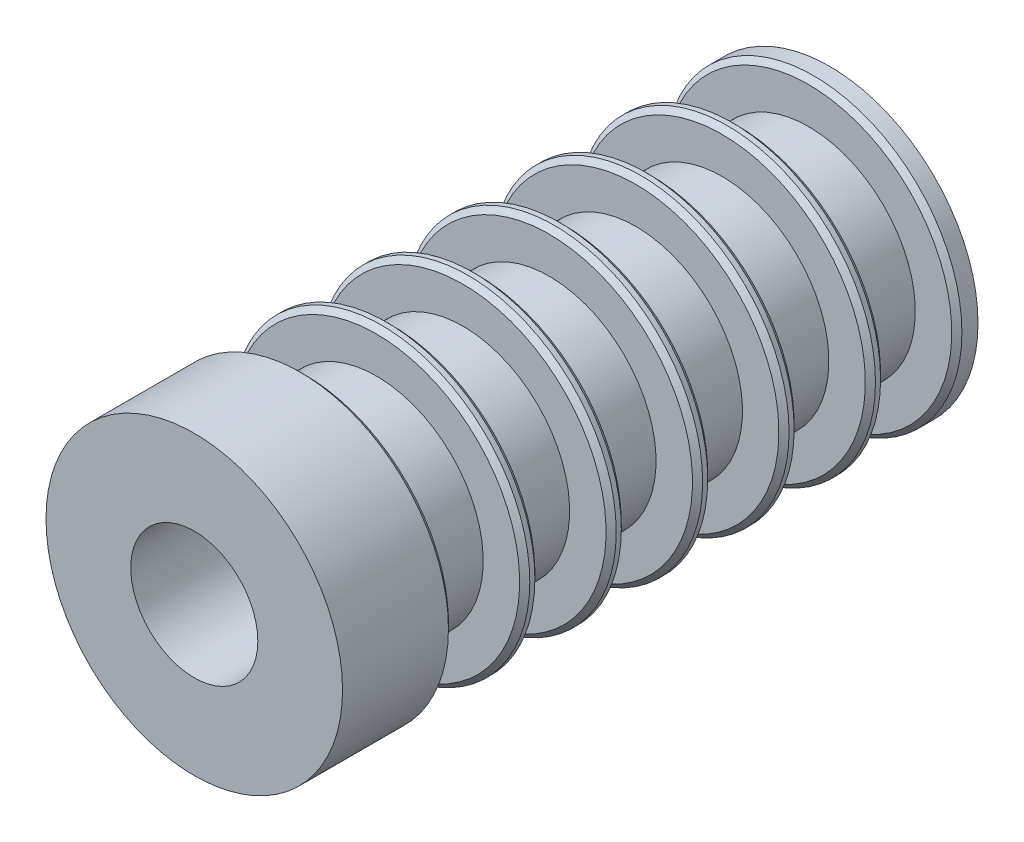
ISO-10303-21;
HEADER;
FILE_DESCRIPTION(('STEP AP214'),'2;1');
FILE_NAME('part.step','',(''),(''),'','','');
FILE_SCHEMA(('AUTOMOTIVE_DESIGN { 1 0 10303 214 1 1 1 1 }'));
ENDSEC;
DATA;
#1=APPLICATION_CONTEXT('core data for automotive mechanical design processes');
#2=APPLICATION_PROTOCOL_DEFINITION('international standard','automotive_design',2000,#1);
#3=PRODUCT_CONTEXT('',#1,'mechanical');
#4=PRODUCT('Part','Part','',(#3));
#5=PRODUCT_RELATED_PRODUCT_CATEGORY('part','',(#4));
#6=PRODUCT_DEFINITION_FORMATION('','',#4);
#7=PRODUCT_DEFINITION_CONTEXT('part definition',#1,'design');
#8=PRODUCT_DEFINITION('design','',#6,#7);
#9=PRODUCT_DEFINITION_SHAPE('','',#8);
#10=(LENGTH_UNIT() NAMED_UNIT(*) SI_UNIT(.MILLI.,.METRE.));
#11=(NAMED_UNIT(*) PLANE_ANGLE_UNIT() SI_UNIT($,.RADIAN.));
#12=(NAMED_UNIT(*) SI_UNIT($,.STERADIAN.) SOLID_ANGLE_UNIT());
#13=UNCERTAINTY_MEASURE_WITH_UNIT(LENGTH_MEASURE(1.E-05),#10,'distance_accuracy_value','');
#14=(GEOMETRIC_REPRESENTATION_CONTEXT(3) GLOBAL_UNCERTAINTY_ASSIGNED_CONTEXT((#13)) GLOBAL_UNIT_ASSIGNED_CONTEXT((#10,
#11,#12)) REPRESENTATION_CONTEXT('',''));
#15=CARTESIAN_POINT('',(0.,0.,0.));
#16=DIRECTION('',(0.,0.,1.));
#17=DIRECTION('',(1.,0.,0.));
#18=AXIS2_PLACEMENT_3D('',#15,#16,#17);
#19=CARTESIAN_POINT('',(0.,0.,25.4));
#20=DIRECTION('',(0.,0.,-1.));
#21=DIRECTION('',(-1.,0.,0.));
#22=AXIS2_PLACEMENT_3D('',#19,#20,#21);
#23=CYLINDRICAL_SURFACE('',#22,11.1125);
#24=CARTESIAN_POINT('',(0.,0.,14.2875));
#25=DIRECTION('',(0.,0.,-1.));
#26=DIRECTION('',(-1.,0.,0.));
#27=AXIS2_PLACEMENT_3D('',#24,#25,#26);
#28=CIRCLE('',#27,11.1125);
#29=CARTESIAN_POINT('',(-11.1125,0.,14.2875));
#30=VERTEX_POINT('',#29);
#31=EDGE_CURVE('E10',#30,#30,#28,.F.);
#32=ORIENTED_EDGE('',*,*,#31,.T.);
#33=EDGE_LOOP('',(#32));
#34=FACE_BOUND('',#33,.T.);
#35=CARTESIAN_POINT('',(0.,0.,22.225));
#36=DIRECTION('',(0.,0.,1.));
#37=DIRECTION('',(1.,0.,0.));
#38=AXIS2_PLACEMENT_3D('',#35,#36,#37);
#39=CIRCLE('',#38,11.1125);
#40=CARTESIAN_POINT('',(11.1125,0.,22.225));
#41=VERTEX_POINT('',#40);
#42=EDGE_CURVE('E116',#41,#41,#39,.T.);
#43=ORIENTED_EDGE('',*,*,#42,.F.);
#44=EDGE_LOOP('',(#43));
#45=FACE_BOUND('',#44,.T.);
#46=ADVANCED_FACE('F33',(#34,#45),#23,.T.);
#47=CARTESIAN_POINT('',(0.,0.,-17.7165));
#48=DIRECTION('',(0.,0.,-1.));
#49=DIRECTION('',(-1.,0.,0.));
#50=AXIS2_PLACEMENT_3D('',#47,#48,#49);
#51=CIRCLE('',#50,11.1125);
#52=CARTESIAN_POINT('',(-11.1125,0.,-17.7165));
#53=VERTEX_POINT('',#52);
#54=EDGE_CURVE('E98',#53,#53,#51,.T.);
#55=ORIENTED_EDGE('',*,*,#54,.T.);
#56=EDGE_LOOP('',(#55));
#57=FACE_BOUND('',#56,.T.);
#58=CARTESIAN_POINT('',(0.,0.,-18.0975));
#59=DIRECTION('',(0.,0.,-1.));
#60=DIRECTION('',(-1.,0.,0.));
#61=AXIS2_PLACEMENT_3D('',#58,#59,#60);
#62=CIRCLE('',#61,11.1125);
#63=CARTESIAN_POINT('',(-11.1125,0.,-18.0975));
#64=VERTEX_POINT('',#63);
#65=EDGE_CURVE('E101',#64,#64,#62,.F.);
#66=ORIENTED_EDGE('',*,*,#65,.T.);
#67=EDGE_LOOP('',(#66));
#68=FACE_BOUND('',#67,.T.);
#69=ADVANCED_FACE('F182',(#57,#68),#23,.T.);
#70=CARTESIAN_POINT('',(0.,0.,-24.1935));
#71=DIRECTION('',(0.,0.,-1.));
#72=DIRECTION('',(-1.,0.,0.));
#73=AXIS2_PLACEMENT_3D('',#70,#71,#72);
#74=CIRCLE('',#73,11.1125);
#75=CARTESIAN_POINT('',(-11.1125,0.,-24.1935));
#76=VERTEX_POINT('',#75);
#77=EDGE_CURVE('E110',#76,#76,#74,.T.);
#78=ORIENTED_EDGE('',*,*,#77,.T.);
#79=EDGE_LOOP('',(#78));
#80=FACE_BOUND('',#79,.T.);
#81=CARTESIAN_POINT('',(0.,0.,-25.4));
#82=DIRECTION('',(0.,0.,1.));
#83=DIRECTION('',(1.,0.,0.));
#84=AXIS2_PLACEMENT_3D('',#81,#82,#83);
#85=CIRCLE('',#84,11.1125);
#86=CARTESIAN_POINT('',(11.1125,0.,-25.4));
#87=VERTEX_POINT('',#86);
#88=EDGE_CURVE('E113',#87,#87,#85,.T.);
#89=ORIENTED_EDGE('',*,*,#88,.T.);
#90=EDGE_LOOP('',(#89));
#91=FACE_BOUND('',#90,.T.);
#92=ADVANCED_FACE('F188',(#80,#91),#23,.T.);
#93=CARTESIAN_POINT('',(0.,0.,-25.4));
#94=DIRECTION('',(0.,0.,1.));
#95=DIRECTION('',(1.,0.,0.));
#96=AXIS2_PLACEMENT_3D('',#93,#94,#95);
#97=PLANE('',#96);
#98=CARTESIAN_POINT('',(0.,0.,-25.4));
#99=DIRECTION('',(0.,0.,1.));
#100=DIRECTION('',(1.,0.,0.));
#101=AXIS2_PLACEMENT_3D('',#98,#99,#100);
#102=CIRCLE('',#101,4.7625);
#103=CARTESIAN_POINT('',(4.7625,0.,-25.4));
#104=VERTEX_POINT('',#103);
#105=EDGE_CURVE('E119',#104,#104,#102,.T.);
#106=ORIENTED_EDGE('',*,*,#105,.T.);
#107=EDGE_LOOP('',(#106));
#108=FACE_BOUND('',#107,.T.);
#109=ORIENTED_EDGE('',*,*,#88,.F.);
#110=EDGE_LOOP('',(#109));
#111=FACE_BOUND('',#110,.T.);
#112=ADVANCED_FACE('F283',(#108,#111),#97,.F.);
#113=CARTESIAN_POINT('',(0.,0.,22.225));
#114=DIRECTION('',(0.,0.,1.));
#115=DIRECTION('',(1.,0.,0.));
#116=AXIS2_PLACEMENT_3D('',#113,#114,#115);
#117=PLANE('',#116);
#118=CARTESIAN_POINT('',(0.,0.,22.225));
#119=DIRECTION('',(0.,0.,1.));
#120=DIRECTION('',(1.,0.,0.));
#121=AXIS2_PLACEMENT_3D('',#118,#119,#120);
#122=CIRCLE('',#121,4.7625);
#123=CARTESIAN_POINT('',(4.7625,0.,22.225));
#124=VERTEX_POINT('',#123);
#125=EDGE_CURVE('E120',#124,#124,#122,.T.);
#126=ORIENTED_EDGE('',*,*,#125,.F.);
#127=EDGE_LOOP('',(#126));
#128=FACE_BOUND('',#127,.T.);
#129=ORIENTED_EDGE('',*,*,#42,.T.);
#130=EDGE_LOOP('',(#129));
#131=FACE_BOUND('',#130,.T.);
#132=ADVANCED_FACE('F280',(#128,#131),#117,.T.);
#133=CARTESIAN_POINT('',(0.,0.,-25.4));
#134=DIRECTION('',(0.,0.,1.));
#135=DIRECTION('',(1.,0.,0.));
#136=AXIS2_PLACEMENT_3D('',#133,#134,#135);
#137=CYLINDRICAL_SURFACE('',#136,4.7625);
#138=ORIENTED_EDGE('',*,*,#105,.F.);
#139=EDGE_LOOP('',(#138));
#140=FACE_BOUND('',#139,.T.);
#141=ORIENTED_EDGE('',*,*,#125,.T.);
#142=EDGE_LOOP('',(#141));
#143=FACE_BOUND('',#142,.T.);
#144=ADVANCED_FACE('F273',(#140,#143),#137,.F.);
#145=CARTESIAN_POINT('',(0.,0.,-18.4785));
#146=DIRECTION('',(0.,0.,-1.));
#147=DIRECTION('',(-1.,0.,0.));
#148=AXIS2_PLACEMENT_3D('',#145,#146,#147);
#149=PLANE('',#148);
#150=CARTESIAN_POINT('',(0.,0.,-18.4785));
#151=DIRECTION('',(0.,0.,-1.));
#152=DIRECTION('',(-1.,0.,0.));
#153=AXIS2_PLACEMENT_3D('',#150,#151,#152);
#154=CIRCLE('',#153,10.7315);
#155=CARTESIAN_POINT('',(-10.7315,0.,-18.4785));
#156=VERTEX_POINT('',#155);
#157=EDGE_CURVE('E104',#156,#156,#154,.T.);
#158=ORIENTED_EDGE('',*,*,#157,.T.);
#159=EDGE_LOOP('',(#158));
#160=FACE_BOUND('',#159,.T.);
#161=CARTESIAN_POINT('',(0.,0.,-18.4785));
#162=DIRECTION('',(0.,0.,-1.));
#163=DIRECTION('',(-1.,0.,0.));
#164=AXIS2_PLACEMENT_3D('',#161,#162,#163);
#165=CIRCLE('',#164,8.001);
#166=CARTESIAN_POINT('',(-8.001,0.,-18.4785));
#167=VERTEX_POINT('',#166);
#168=EDGE_CURVE('E123',#167,#167,#165,.T.);
#169=ORIENTED_EDGE('',*,*,#168,.F.);
#170=EDGE_LOOP('',(#169));
#171=FACE_BOUND('',#170,.T.);
#172=ADVANCED_FACE('F270',(#160,#171),#149,.T.);
#173=CARTESIAN_POINT('',(0.,0.,-23.8125));
#174=DIRECTION('',(0.,0.,-1.));
#175=DIRECTION('',(-1.,0.,0.));
#176=AXIS2_PLACEMENT_3D('',#173,#174,#175);
#177=PLANE('',#176);
#178=CARTESIAN_POINT('',(0.,0.,-23.8125));
#179=DIRECTION('',(0.,0.,-1.));
#180=DIRECTION('',(-1.,0.,0.));
#181=AXIS2_PLACEMENT_3D('',#178,#179,#180);
#182=CIRCLE('',#181,10.7315);
#183=CARTESIAN_POINT('',(-10.7315,0.,-23.8125));
#184=VERTEX_POINT('',#183);
#185=EDGE_CURVE('E107',#184,#184,#182,.F.);
#186=ORIENTED_EDGE('',*,*,#185,.T.);
#187=EDGE_LOOP('',(#186));
#188=FACE_BOUND('',#187,.T.);
#189=CARTESIAN_POINT('',(0.,0.,-23.8125));
#190=DIRECTION('',(0.,0.,-1.));
#191=DIRECTION('',(-1.,0.,0.));
#192=AXIS2_PLACEMENT_3D('',#189,#190,#191);
#193=CIRCLE('',#192,8.001);
#194=CARTESIAN_POINT('',(-8.001,0.,-23.8125));
#195=VERTEX_POINT('',#194);
#196=EDGE_CURVE('E126',#195,#195,#193,.T.);
#197=ORIENTED_EDGE('',*,*,#196,.T.);
#198=EDGE_LOOP('',(#197));
#199=FACE_BOUND('',#198,.T.);
#200=ADVANCED_FACE('F268',(#188,#199),#177,.F.);
#201=CARTESIAN_POINT('',(0.,0.,-18.4785));
#202=DIRECTION('',(0.,0.,-1.));
#203=DIRECTION('',(-1.,0.,0.));
#204=AXIS2_PLACEMENT_3D('',#201,#202,#203);
#205=CYLINDRICAL_SURFACE('',#204,8.001);
#206=ORIENTED_EDGE('',*,*,#168,.T.);
#207=EDGE_LOOP('',(#206));
#208=FACE_BOUND('',#207,.T.);
#209=ORIENTED_EDGE('',*,*,#196,.F.);
#210=EDGE_LOOP('',(#209));
#211=FACE_BOUND('',#210,.T.);
#212=ADVANCED_FACE('F264',(#208,#211),#205,.T.);
#213=CARTESIAN_POINT('',(0.,0.,-24.1935));
#214=DIRECTION('',(0.,0.,-1.));
#215=DIRECTION('',(-1.,0.,0.));
#216=AXIS2_PLACEMENT_3D('',#213,#214,#215);
#217=CONICAL_SURFACE('',#216,11.1125,0.785398163397448);
#218=ORIENTED_EDGE('',*,*,#185,.F.);
#219=EDGE_LOOP('',(#218));
#220=FACE_BOUND('',#219,.T.);
#221=ORIENTED_EDGE('',*,*,#77,.F.);
#222=EDGE_LOOP('',(#221));
#223=FACE_BOUND('',#222,.T.);
#224=ADVANCED_FACE('F267',(#220,#223),#217,.T.);
#225=CARTESIAN_POINT('',(0.,0.,-18.4785));
#226=DIRECTION('',(0.,0.,1.));
#227=DIRECTION('',(1.,0.,0.));
#228=AXIS2_PLACEMENT_3D('',#225,#226,#227);
#229=CONICAL_SURFACE('',#228,10.7315,0.785398163397444);
#230=ORIENTED_EDGE('',*,*,#65,.F.);
#231=EDGE_LOOP('',(#230));
#232=FACE_BOUND('',#231,.T.);
#233=ORIENTED_EDGE('',*,*,#157,.F.);
#234=EDGE_LOOP('',(#233));
#235=FACE_BOUND('',#234,.T.);
#236=ADVANCED_FACE('F260',(#232,#235),#229,.T.);
#237=CARTESIAN_POINT('',(0.,0.,13.9065));
#238=DIRECTION('',(0.,0.,-1.));
#239=DIRECTION('',(-1.,0.,0.));
#240=AXIS2_PLACEMENT_3D('',#237,#238,#239);
#241=PLANE('',#240);
#242=CARTESIAN_POINT('',(0.,0.,13.9065));
#243=DIRECTION('',(0.,0.,-1.));
#244=DIRECTION('',(-1.,0.,0.));
#245=AXIS2_PLACEMENT_3D('',#242,#243,#244);
#246=CIRCLE('',#245,10.7315);
#247=CARTESIAN_POINT('',(-10.7315,0.,13.9065));
#248=VERTEX_POINT('',#247);
#249=EDGE_CURVE('E40',#248,#248,#246,.T.);
#250=ORIENTED_EDGE('',*,*,#249,.T.);
#251=EDGE_LOOP('',(#250));
#252=FACE_BOUND('',#251,.T.);
#253=CARTESIAN_POINT('',(0.,0.,13.9065));
#254=DIRECTION('',(0.,0.,-1.));
#255=DIRECTION('',(-1.,0.,0.));
#256=AXIS2_PLACEMENT_3D('',#253,#254,#255);
#257=CIRCLE('',#256,8.001);
#258=CARTESIAN_POINT('',(-8.001,0.,13.9065));
#259=VERTEX_POINT('',#258);
#260=EDGE_CURVE('E135',#259,#259,#257,.T.);
#261=ORIENTED_EDGE('',*,*,#260,.F.);
#262=EDGE_LOOP('',(#261));
#263=FACE_BOUND('',#262,.T.);
#264=ADVANCED_FACE('F257',(#252,#263),#241,.T.);
#265=CARTESIAN_POINT('',(0.,0.,8.5725));
#266=DIRECTION('',(0.,0.,-1.));
#267=DIRECTION('',(-1.,0.,0.));
#268=AXIS2_PLACEMENT_3D('',#265,#266,#267);
#269=PLANE('',#268);
#270=CARTESIAN_POINT('',(0.,0.,8.5725));
#271=DIRECTION('',(0.,0.,-1.));
#272=DIRECTION('',(-1.,0.,0.));
#273=AXIS2_PLACEMENT_3D('',#270,#271,#272);
#274=CIRCLE('',#273,10.7315);
#275=CARTESIAN_POINT('',(-10.7315,0.,8.5725));
#276=VERTEX_POINT('',#275);
#277=EDGE_CURVE('E44',#276,#276,#274,.F.);
#278=ORIENTED_EDGE('',*,*,#277,.T.);
#279=EDGE_LOOP('',(#278));
#280=FACE_BOUND('',#279,.T.);
#281=CARTESIAN_POINT('',(0.,0.,8.5725));
#282=DIRECTION('',(0.,0.,-1.));
#283=DIRECTION('',(-1.,0.,0.));
#284=AXIS2_PLACEMENT_3D('',#281,#282,#283);
#285=CIRCLE('',#284,8.001);
#286=CARTESIAN_POINT('',(-8.001,0.,8.5725));
#287=VERTEX_POINT('',#286);
#288=EDGE_CURVE('E132',#287,#287,#285,.T.);
#289=ORIENTED_EDGE('',*,*,#288,.T.);
#290=EDGE_LOOP('',(#289));
#291=FACE_BOUND('',#290,.T.);
#292=ADVANCED_FACE('F177',(#280,#291),#269,.F.);
#293=CARTESIAN_POINT('',(0.,0.,13.9065));
#294=DIRECTION('',(0.,0.,-1.));
#295=DIRECTION('',(-1.,0.,0.));
#296=AXIS2_PLACEMENT_3D('',#293,#294,#295);
#297=CYLINDRICAL_SURFACE('',#296,8.001);
#298=ORIENTED_EDGE('',*,*,#260,.T.);
#299=EDGE_LOOP('',(#298));
#300=FACE_BOUND('',#299,.T.);
#301=ORIENTED_EDGE('',*,*,#288,.F.);
#302=EDGE_LOOP('',(#301));
#303=FACE_BOUND('',#302,.T.);
#304=ADVANCED_FACE('F168',(#300,#303),#297,.T.);
#305=CARTESIAN_POINT('',(0.,0.,-12.0015));
#306=DIRECTION('',(0.,0.,-1.));
#307=DIRECTION('',(-1.,0.,0.));
#308=AXIS2_PLACEMENT_3D('',#305,#306,#307);
#309=PLANE('',#308);
#310=CARTESIAN_POINT('',(0.,0.,-12.0015));
#311=DIRECTION('',(0.,0.,-1.));
#312=DIRECTION('',(-1.,0.,0.));
#313=AXIS2_PLACEMENT_3D('',#310,#311,#312);
#314=CIRCLE('',#313,10.7315);
#315=CARTESIAN_POINT('',(-10.7315,0.,-12.0015));
#316=VERTEX_POINT('',#315);
#317=EDGE_CURVE('E92',#316,#316,#314,.T.);
#318=ORIENTED_EDGE('',*,*,#317,.T.);
#319=EDGE_LOOP('',(#318));
#320=FACE_BOUND('',#319,.T.);
#321=CARTESIAN_POINT('',(0.,0.,-12.0015));
#322=DIRECTION('',(0.,0.,-1.));
#323=DIRECTION('',(-1.,0.,0.));
#324=AXIS2_PLACEMENT_3D('',#321,#322,#323);
#325=CIRCLE('',#324,8.001);
#326=CARTESIAN_POINT('',(-8.001,0.,-12.0015));
#327=VERTEX_POINT('',#326);
#328=EDGE_CURVE('E129',#327,#327,#325,.T.);
#329=ORIENTED_EDGE('',*,*,#328,.F.);
#330=EDGE_LOOP('',(#329));
#331=FACE_BOUND('',#330,.T.);
#332=ADVANCED_FACE('F165',(#320,#331),#309,.T.);
#333=CARTESIAN_POINT('',(0.,0.,-17.3355));
#334=DIRECTION('',(0.,0.,-1.));
#335=DIRECTION('',(-1.,0.,0.));
#336=AXIS2_PLACEMENT_3D('',#333,#334,#335);
#337=PLANE('',#336);
#338=CARTESIAN_POINT('',(0.,0.,-17.3355));
#339=DIRECTION('',(0.,0.,-1.));
#340=DIRECTION('',(-1.,0.,0.));
#341=AXIS2_PLACEMENT_3D('',#338,#339,#340);
#342=CIRCLE('',#341,10.7315);
#343=CARTESIAN_POINT('',(-10.7315,0.,-17.3355));
#344=VERTEX_POINT('',#343);
#345=EDGE_CURVE('E95',#344,#344,#342,.F.);
#346=ORIENTED_EDGE('',*,*,#345,.T.);
#347=EDGE_LOOP('',(#346));
#348=FACE_BOUND('',#347,.T.);
#349=CARTESIAN_POINT('',(0.,0.,-17.3355));
#350=DIRECTION('',(0.,0.,-1.));
#351=DIRECTION('',(-1.,0.,0.));
#352=AXIS2_PLACEMENT_3D('',#349,#350,#351);
#353=CIRCLE('',#352,8.001);
#354=CARTESIAN_POINT('',(-8.001,0.,-17.3355));
#355=VERTEX_POINT('',#354);
#356=EDGE_CURVE('E156',#355,#355,#353,.T.);
#357=ORIENTED_EDGE('',*,*,#356,.T.);
#358=EDGE_LOOP('',(#357));
#359=FACE_BOUND('',#358,.T.);
#360=ADVANCED_FACE('F167',(#348,#359),#337,.F.);
#361=CARTESIAN_POINT('',(0.,0.,-12.0015));
#362=DIRECTION('',(0.,0.,-1.));
#363=DIRECTION('',(-1.,0.,0.));
#364=AXIS2_PLACEMENT_3D('',#361,#362,#363);
#365=CYLINDRICAL_SURFACE('',#364,8.001);
#366=ORIENTED_EDGE('',*,*,#328,.T.);
#367=EDGE_LOOP('',(#366));
#368=FACE_BOUND('',#367,.T.);
#369=ORIENTED_EDGE('',*,*,#356,.F.);
#370=EDGE_LOOP('',(#369));
#371=FACE_BOUND('',#370,.T.);
#372=ADVANCED_FACE('F162',(#368,#371),#365,.T.);
#373=CARTESIAN_POINT('',(0.,0.,8.1915));
#374=DIRECTION('',(0.,0.,-1.));
#375=DIRECTION('',(-1.,0.,0.));
#376=AXIS2_PLACEMENT_3D('',#373,#374,#375);
#377=CIRCLE('',#376,11.1125);
#378=CARTESIAN_POINT('',(-11.1125,0.,8.1915));
#379=VERTEX_POINT('',#378);
#380=EDGE_CURVE('E48',#379,#379,#377,.T.);
#381=ORIENTED_EDGE('',*,*,#380,.T.);
#382=EDGE_LOOP('',(#381));
#383=FACE_BOUND('',#382,.T.);
#384=CARTESIAN_POINT('',(0.,0.,7.8105));
#385=DIRECTION('',(0.,0.,-1.));
#386=DIRECTION('',(-1.,0.,0.));
#387=AXIS2_PLACEMENT_3D('',#384,#385,#386);
#388=CIRCLE('',#387,11.1125);
#389=CARTESIAN_POINT('',(-11.1125,0.,7.8105));
#390=VERTEX_POINT('',#389);
#391=EDGE_CURVE('E53',#390,#390,#388,.F.);
#392=ORIENTED_EDGE('',*,*,#391,.T.);
#393=EDGE_LOOP('',(#392));
#394=FACE_BOUND('',#393,.T.);
#395=ADVANCED_FACE('F184',(#383,#394),#23,.T.);
#396=CARTESIAN_POINT('',(0.,0.,7.4295));
#397=DIRECTION('',(0.,0.,-1.));
#398=DIRECTION('',(-1.,0.,0.));
#399=AXIS2_PLACEMENT_3D('',#396,#397,#398);
#400=PLANE('',#399);
#401=CARTESIAN_POINT('',(0.,0.,7.4295));
#402=DIRECTION('',(0.,0.,-1.));
#403=DIRECTION('',(-1.,0.,0.));
#404=AXIS2_PLACEMENT_3D('',#401,#402,#403);
#405=CIRCLE('',#404,10.7315);
#406=CARTESIAN_POINT('',(-10.7315,0.,7.4295));
#407=VERTEX_POINT('',#406);
#408=EDGE_CURVE('E56',#407,#407,#405,.T.);
#409=ORIENTED_EDGE('',*,*,#408,.T.);
#410=EDGE_LOOP('',(#409));
#411=FACE_BOUND('',#410,.T.);
#412=CARTESIAN_POINT('',(0.,0.,7.4295));
#413=DIRECTION('',(0.,0.,-1.));
#414=DIRECTION('',(-1.,0.,0.));
#415=AXIS2_PLACEMENT_3D('',#412,#413,#414);
#416=CIRCLE('',#415,8.001);
#417=CARTESIAN_POINT('',(-8.001,0.,7.4295));
#418=VERTEX_POINT('',#417);
#419=EDGE_CURVE('E141',#418,#418,#416,.T.);
#420=ORIENTED_EDGE('',*,*,#419,.F.);
#421=EDGE_LOOP('',(#420));
#422=FACE_BOUND('',#421,.T.);
#423=ADVANCED_FACE('F194',(#411,#422),#400,.T.);
#424=CARTESIAN_POINT('',(0.,0.,2.0955));
#425=DIRECTION('',(0.,0.,-1.));
#426=DIRECTION('',(-1.,0.,0.));
#427=AXIS2_PLACEMENT_3D('',#424,#425,#426);
#428=PLANE('',#427);
#429=CARTESIAN_POINT('',(0.,0.,2.0955));
#430=DIRECTION('',(0.,0.,-1.));
#431=DIRECTION('',(-1.,0.,0.));
#432=AXIS2_PLACEMENT_3D('',#429,#430,#431);
#433=CIRCLE('',#432,10.7315);
#434=CARTESIAN_POINT('',(-10.7315,0.,2.0955));
#435=VERTEX_POINT('',#434);
#436=EDGE_CURVE('E59',#435,#435,#433,.F.);
#437=ORIENTED_EDGE('',*,*,#436,.T.);
#438=EDGE_LOOP('',(#437));
#439=FACE_BOUND('',#438,.T.);
#440=CARTESIAN_POINT('',(0.,0.,2.0955));
#441=DIRECTION('',(0.,0.,-1.));
#442=DIRECTION('',(-1.,0.,0.));
#443=AXIS2_PLACEMENT_3D('',#440,#441,#442);
#444=CIRCLE('',#443,8.001);
#445=CARTESIAN_POINT('',(-8.001,0.,2.0955));
#446=VERTEX_POINT('',#445);
#447=EDGE_CURVE('E138',#446,#446,#444,.T.);
#448=ORIENTED_EDGE('',*,*,#447,.T.);
#449=EDGE_LOOP('',(#448));
#450=FACE_BOUND('',#449,.T.);
#451=ADVANCED_FACE('F201',(#439,#450),#428,.F.);
#452=CARTESIAN_POINT('',(0.,0.,7.4295));
#453=DIRECTION('',(0.,0.,-1.));
#454=DIRECTION('',(-1.,0.,0.));
#455=AXIS2_PLACEMENT_3D('',#452,#453,#454);
#456=CYLINDRICAL_SURFACE('',#455,8.001);
#457=ORIENTED_EDGE('',*,*,#419,.T.);
#458=EDGE_LOOP('',(#457));
#459=FACE_BOUND('',#458,.T.);
#460=ORIENTED_EDGE('',*,*,#447,.F.);
#461=EDGE_LOOP('',(#460));
#462=FACE_BOUND('',#461,.T.);
#463=ADVANCED_FACE('F250',(#459,#462),#456,.T.);
#464=CARTESIAN_POINT('',(0.,0.,-11.2395));
#465=DIRECTION('',(0.,0.,-1.));
#466=DIRECTION('',(-1.,0.,0.));
#467=AXIS2_PLACEMENT_3D('',#464,#465,#466);
#468=CIRCLE('',#467,11.1125);
#469=CARTESIAN_POINT('',(-11.1125,0.,-11.2395));
#470=VERTEX_POINT('',#469);
#471=EDGE_CURVE('E86',#470,#470,#468,.T.);
#472=ORIENTED_EDGE('',*,*,#471,.T.);
#473=EDGE_LOOP('',(#472));
#474=FACE_BOUND('',#473,.T.);
#475=CARTESIAN_POINT('',(0.,0.,-11.6205));
#476=DIRECTION('',(0.,0.,-1.));
#477=DIRECTION('',(-1.,0.,0.));
#478=AXIS2_PLACEMENT_3D('',#475,#476,#477);
#479=CIRCLE('',#478,11.1125);
#480=CARTESIAN_POINT('',(-11.1125,0.,-11.6205));
#481=VERTEX_POINT('',#480);
#482=EDGE_CURVE('E89',#481,#481,#479,.F.);
#483=ORIENTED_EDGE('',*,*,#482,.T.);
#484=EDGE_LOOP('',(#483));
#485=FACE_BOUND('',#484,.T.);
#486=ADVANCED_FACE('F215',(#474,#485),#23,.T.);
#487=CARTESIAN_POINT('',(0.,0.,-5.5245));
#488=DIRECTION('',(0.,0.,-1.));
#489=DIRECTION('',(-1.,0.,0.));
#490=AXIS2_PLACEMENT_3D('',#487,#488,#489);
#491=PLANE('',#490);
#492=CARTESIAN_POINT('',(0.,0.,-5.5245));
#493=DIRECTION('',(0.,0.,-1.));
#494=DIRECTION('',(-1.,0.,0.));
#495=AXIS2_PLACEMENT_3D('',#492,#493,#494);
#496=CIRCLE('',#495,10.7315);
#497=CARTESIAN_POINT('',(-10.7315,0.,-5.5245));
#498=VERTEX_POINT('',#497);
#499=EDGE_CURVE('E80',#498,#498,#496,.T.);
#500=ORIENTED_EDGE('',*,*,#499,.T.);
#501=EDGE_LOOP('',(#500));
#502=FACE_BOUND('',#501,.T.);
#503=CARTESIAN_POINT('',(0.,0.,-5.5245));
#504=DIRECTION('',(0.,0.,-1.));
#505=DIRECTION('',(-1.,0.,0.));
#506=AXIS2_PLACEMENT_3D('',#503,#504,#505);
#507=CIRCLE('',#506,8.001);
#508=CARTESIAN_POINT('',(-8.001,0.,-5.5245));
#509=VERTEX_POINT('',#508);
#510=EDGE_CURVE('E153',#509,#509,#507,.T.);
#511=ORIENTED_EDGE('',*,*,#510,.F.);
#512=EDGE_LOOP('',(#511));
#513=FACE_BOUND('',#512,.T.);
#514=ADVANCED_FACE('F302',(#502,#513),#491,.T.);
#515=CARTESIAN_POINT('',(0.,0.,-10.8585));
#516=DIRECTION('',(0.,0.,-1.));
#517=DIRECTION('',(-1.,0.,0.));
#518=AXIS2_PLACEMENT_3D('',#515,#516,#517);
#519=PLANE('',#518);
#520=CARTESIAN_POINT('',(0.,0.,-10.8585));
#521=DIRECTION('',(0.,0.,-1.));
#522=DIRECTION('',(-1.,0.,0.));
#523=AXIS2_PLACEMENT_3D('',#520,#521,#522);
#524=CIRCLE('',#523,10.7315);
#525=CARTESIAN_POINT('',(-10.7315,0.,-10.8585));
#526=VERTEX_POINT('',#525);
#527=EDGE_CURVE('E83',#526,#526,#524,.F.);
#528=ORIENTED_EDGE('',*,*,#527,.T.);
#529=EDGE_LOOP('',(#528));
#530=FACE_BOUND('',#529,.T.);
#531=CARTESIAN_POINT('',(0.,0.,-10.8585));
#532=DIRECTION('',(0.,0.,-1.));
#533=DIRECTION('',(-1.,0.,0.));
#534=AXIS2_PLACEMENT_3D('',#531,#532,#533);
#535=CIRCLE('',#534,8.001);
#536=CARTESIAN_POINT('',(-8.001,0.,-10.8585));
#537=VERTEX_POINT('',#536);
#538=EDGE_CURVE('E150',#537,#537,#535,.T.);
#539=ORIENTED_EDGE('',*,*,#538,.T.);
#540=EDGE_LOOP('',(#539));
#541=FACE_BOUND('',#540,.T.);
#542=ADVANCED_FACE('F216',(#530,#541),#519,.F.);
#543=CARTESIAN_POINT('',(0.,0.,-5.5245));
#544=DIRECTION('',(0.,0.,-1.));
#545=DIRECTION('',(-1.,0.,0.));
#546=AXIS2_PLACEMENT_3D('',#543,#544,#545);
#547=CYLINDRICAL_SURFACE('',#546,8.001);
#548=ORIENTED_EDGE('',*,*,#510,.T.);
#549=EDGE_LOOP('',(#548));
#550=FACE_BOUND('',#549,.T.);
#551=ORIENTED_EDGE('',*,*,#538,.F.);
#552=EDGE_LOOP('',(#551));
#553=FACE_BOUND('',#552,.T.);
#554=ADVANCED_FACE('F207',(#550,#553),#547,.T.);
#555=CARTESIAN_POINT('',(0.,0.,1.7145));
#556=DIRECTION('',(0.,0.,-1.));
#557=DIRECTION('',(-1.,0.,0.));
#558=AXIS2_PLACEMENT_3D('',#555,#556,#557);
#559=CIRCLE('',#558,11.1125);
#560=CARTESIAN_POINT('',(-11.1125,0.,1.7145));
#561=VERTEX_POINT('',#560);
#562=EDGE_CURVE('E62',#561,#561,#559,.T.);
#563=ORIENTED_EDGE('',*,*,#562,.T.);
#564=EDGE_LOOP('',(#563));
#565=FACE_BOUND('',#564,.T.);
#566=CARTESIAN_POINT('',(0.,0.,1.3335));
#567=DIRECTION('',(0.,0.,-1.));
#568=DIRECTION('',(-1.,0.,0.));
#569=AXIS2_PLACEMENT_3D('',#566,#567,#568);
#570=CIRCLE('',#569,11.1125);
#571=CARTESIAN_POINT('',(-11.1125,0.,1.3335));
#572=VERTEX_POINT('',#571);
#573=EDGE_CURVE('E65',#572,#572,#570,.F.);
#574=ORIENTED_EDGE('',*,*,#573,.T.);
#575=EDGE_LOOP('',(#574));
#576=FACE_BOUND('',#575,.T.);
#577=ADVANCED_FACE('F196',(#565,#576),#23,.T.);
#578=CARTESIAN_POINT('',(0.,0.,-4.7625));
#579=DIRECTION('',(0.,0.,-1.));
#580=DIRECTION('',(-1.,0.,0.));
#581=AXIS2_PLACEMENT_3D('',#578,#579,#580);
#582=CIRCLE('',#581,11.1125);
#583=CARTESIAN_POINT('',(-11.1125,0.,-4.7625));
#584=VERTEX_POINT('',#583);
#585=EDGE_CURVE('E74',#584,#584,#582,.T.);
#586=ORIENTED_EDGE('',*,*,#585,.T.);
#587=EDGE_LOOP('',(#586));
#588=FACE_BOUND('',#587,.T.);
#589=CARTESIAN_POINT('',(0.,0.,-5.1435));
#590=DIRECTION('',(0.,0.,-1.));
#591=DIRECTION('',(-1.,0.,0.));
#592=AXIS2_PLACEMENT_3D('',#589,#590,#591);
#593=CIRCLE('',#592,11.1125);
#594=CARTESIAN_POINT('',(-11.1125,0.,-5.1435));
#595=VERTEX_POINT('',#594);
#596=EDGE_CURVE('E77',#595,#595,#593,.F.);
#597=ORIENTED_EDGE('',*,*,#596,.T.);
#598=EDGE_LOOP('',(#597));
#599=FACE_BOUND('',#598,.T.);
#600=ADVANCED_FACE('F206',(#588,#599),#23,.T.);
#601=CARTESIAN_POINT('',(0.,0.,0.952500000000001));
#602=DIRECTION('',(0.,0.,-1.));
#603=DIRECTION('',(-1.,0.,0.));
#604=AXIS2_PLACEMENT_3D('',#601,#602,#603);
#605=PLANE('',#604);
#606=CARTESIAN_POINT('',(0.,0.,0.952500000000001));
#607=DIRECTION('',(0.,0.,-1.));
#608=DIRECTION('',(-1.,0.,0.));
#609=AXIS2_PLACEMENT_3D('',#606,#607,#608);
#610=CIRCLE('',#609,10.7315);
#611=CARTESIAN_POINT('',(-10.7315,0.,0.952500000000001));
#612=VERTEX_POINT('',#611);
#613=EDGE_CURVE('E68',#612,#612,#610,.T.);
#614=ORIENTED_EDGE('',*,*,#613,.T.);
#615=EDGE_LOOP('',(#614));
#616=FACE_BOUND('',#615,.T.);
#617=CARTESIAN_POINT('',(0.,0.,0.952500000000001));
#618=DIRECTION('',(0.,0.,-1.));
#619=DIRECTION('',(-1.,0.,0.));
#620=AXIS2_PLACEMENT_3D('',#617,#618,#619);
#621=CIRCLE('',#620,8.001);
#622=CARTESIAN_POINT('',(-8.001,0.,0.952500000000001));
#623=VERTEX_POINT('',#622);
#624=EDGE_CURVE('E147',#623,#623,#621,.T.);
#625=ORIENTED_EDGE('',*,*,#624,.F.);
#626=EDGE_LOOP('',(#625));
#627=FACE_BOUND('',#626,.T.);
#628=ADVANCED_FACE('F213',(#616,#627),#605,.T.);
#629=CARTESIAN_POINT('',(0.,0.,-4.3815));
#630=DIRECTION('',(0.,0.,-1.));
#631=DIRECTION('',(-1.,0.,0.));
#632=AXIS2_PLACEMENT_3D('',#629,#630,#631);
#633=PLANE('',#632);
#634=CARTESIAN_POINT('',(0.,0.,-4.3815));
#635=DIRECTION('',(0.,0.,-1.));
#636=DIRECTION('',(-1.,0.,0.));
#637=AXIS2_PLACEMENT_3D('',#634,#635,#636);
#638=CIRCLE('',#637,10.7315);
#639=CARTESIAN_POINT('',(-10.7315,0.,-4.3815));
#640=VERTEX_POINT('',#639);
#641=EDGE_CURVE('E71',#640,#640,#638,.F.);
#642=ORIENTED_EDGE('',*,*,#641,.T.);
#643=EDGE_LOOP('',(#642));
#644=FACE_BOUND('',#643,.T.);
#645=CARTESIAN_POINT('',(0.,0.,-4.3815));
#646=DIRECTION('',(0.,0.,-1.));
#647=DIRECTION('',(-1.,0.,0.));
#648=AXIS2_PLACEMENT_3D('',#645,#646,#647);
#649=CIRCLE('',#648,8.001);
#650=CARTESIAN_POINT('',(-8.001,0.,-4.3815));
#651=VERTEX_POINT('',#650);
#652=EDGE_CURVE('E144',#651,#651,#649,.T.);
#653=ORIENTED_EDGE('',*,*,#652,.T.);
#654=EDGE_LOOP('',(#653));
#655=FACE_BOUND('',#654,.T.);
#656=ADVANCED_FACE('F233',(#644,#655),#633,.F.);
#657=CARTESIAN_POINT('',(0.,0.,0.952500000000001));
#658=DIRECTION('',(0.,0.,-1.));
#659=DIRECTION('',(-1.,0.,0.));
#660=AXIS2_PLACEMENT_3D('',#657,#658,#659);
#661=CYLINDRICAL_SURFACE('',#660,8.001);
#662=ORIENTED_EDGE('',*,*,#624,.T.);
#663=EDGE_LOOP('',(#662));
#664=FACE_BOUND('',#663,.T.);
#665=ORIENTED_EDGE('',*,*,#652,.F.);
#666=EDGE_LOOP('',(#665));
#667=FACE_BOUND('',#666,.T.);
#668=ADVANCED_FACE('F237',(#664,#667),#661,.T.);
#669=CARTESIAN_POINT('',(0.,0.,-17.7165));
#670=DIRECTION('',(0.,0.,-1.));
#671=DIRECTION('',(-1.,0.,0.));
#672=AXIS2_PLACEMENT_3D('',#669,#670,#671);
#673=CONICAL_SURFACE('',#672,11.1125,0.785398163397448);
#674=ORIENTED_EDGE('',*,*,#345,.F.);
#675=EDGE_LOOP('',(#674));
#676=FACE_BOUND('',#675,.T.);
#677=ORIENTED_EDGE('',*,*,#54,.F.);
#678=EDGE_LOOP('',(#677));
#679=FACE_BOUND('',#678,.T.);
#680=ADVANCED_FACE('F240',(#676,#679),#673,.T.);
#681=CARTESIAN_POINT('',(0.,0.,-12.0015));
#682=DIRECTION('',(0.,0.,1.));
#683=DIRECTION('',(1.,0.,0.));
#684=AXIS2_PLACEMENT_3D('',#681,#682,#683);
#685=CONICAL_SURFACE('',#684,10.7315,0.785398163397444);
#686=ORIENTED_EDGE('',*,*,#482,.F.);
#687=EDGE_LOOP('',(#686));
#688=FACE_BOUND('',#687,.T.);
#689=ORIENTED_EDGE('',*,*,#317,.F.);
#690=EDGE_LOOP('',(#689));
#691=FACE_BOUND('',#690,.T.);
#692=ADVANCED_FACE('F313',(#688,#691),#685,.T.);
#693=CARTESIAN_POINT('',(0.,0.,-11.2395));
#694=DIRECTION('',(0.,0.,-1.));
#695=DIRECTION('',(-1.,0.,0.));
#696=AXIS2_PLACEMENT_3D('',#693,#694,#695);
#697=CONICAL_SURFACE('',#696,11.1125,0.785398163397455);
#698=ORIENTED_EDGE('',*,*,#527,.F.);
#699=EDGE_LOOP('',(#698));
#700=FACE_BOUND('',#699,.T.);
#701=ORIENTED_EDGE('',*,*,#471,.F.);
#702=EDGE_LOOP('',(#701));
#703=FACE_BOUND('',#702,.T.);
#704=ADVANCED_FACE('F316',(#700,#703),#697,.T.);
#705=CARTESIAN_POINT('',(0.,0.,-5.5245));
#706=DIRECTION('',(0.,0.,1.));
#707=DIRECTION('',(1.,0.,0.));
#708=AXIS2_PLACEMENT_3D('',#705,#706,#707);
#709=CONICAL_SURFACE('',#708,10.7315,0.785398163397448);
#710=ORIENTED_EDGE('',*,*,#596,.F.);
#711=EDGE_LOOP('',(#710));
#712=FACE_BOUND('',#711,.T.);
#713=ORIENTED_EDGE('',*,*,#499,.F.);
#714=EDGE_LOOP('',(#713));
#715=FACE_BOUND('',#714,.T.);
#716=ADVANCED_FACE('F323',(#712,#715),#709,.T.);
#717=CARTESIAN_POINT('',(0.,0.,-4.7625));
#718=DIRECTION('',(0.,0.,-1.));
#719=DIRECTION('',(-1.,0.,0.));
#720=AXIS2_PLACEMENT_3D('',#717,#718,#719);
#721=CONICAL_SURFACE('',#720,11.1125,0.785398163397446);
#722=ORIENTED_EDGE('',*,*,#641,.F.);
#723=EDGE_LOOP('',(#722));
#724=FACE_BOUND('',#723,.T.);
#725=ORIENTED_EDGE('',*,*,#585,.F.);
#726=EDGE_LOOP('',(#725));
#727=FACE_BOUND('',#726,.T.);
#728=ADVANCED_FACE('F227',(#724,#727),#721,.T.);
#729=CARTESIAN_POINT('',(0.,0.,0.952500000000002));
#730=DIRECTION('',(0.,0.,1.));
#731=DIRECTION('',(1.,0.,0.));
#732=AXIS2_PLACEMENT_3D('',#729,#730,#731);
#733=CONICAL_SURFACE('',#732,10.7315,0.785398163397448);
#734=ORIENTED_EDGE('',*,*,#573,.F.);
#735=EDGE_LOOP('',(#734));
#736=FACE_BOUND('',#735,.T.);
#737=ORIENTED_EDGE('',*,*,#613,.F.);
#738=EDGE_LOOP('',(#737));
#739=FACE_BOUND('',#738,.T.);
#740=ADVANCED_FACE('F223',(#736,#739),#733,.T.);
#741=CARTESIAN_POINT('',(0.,0.,1.7145));
#742=DIRECTION('',(0.,0.,-1.));
#743=DIRECTION('',(-1.,0.,0.));
#744=AXIS2_PLACEMENT_3D('',#741,#742,#743);
#745=CONICAL_SURFACE('',#744,11.1125,0.785398163397451);
#746=ORIENTED_EDGE('',*,*,#436,.F.);
#747=EDGE_LOOP('',(#746));
#748=FACE_BOUND('',#747,.T.);
#749=ORIENTED_EDGE('',*,*,#562,.F.);
#750=EDGE_LOOP('',(#749));
#751=FACE_BOUND('',#750,.T.);
#752=ADVANCED_FACE('F226',(#748,#751),#745,.T.);
#753=CARTESIAN_POINT('',(0.,0.,7.4295));
#754=DIRECTION('',(0.,0.,1.));
#755=DIRECTION('',(1.,0.,0.));
#756=AXIS2_PLACEMENT_3D('',#753,#754,#755);
#757=CONICAL_SURFACE('',#756,10.7315,0.785398163397444);
#758=ORIENTED_EDGE('',*,*,#391,.F.);
#759=EDGE_LOOP('',(#758));
#760=FACE_BOUND('',#759,.T.);
#761=ORIENTED_EDGE('',*,*,#408,.F.);
#762=EDGE_LOOP('',(#761));
#763=FACE_BOUND('',#762,.T.);
#764=ADVANCED_FACE('F338',(#760,#763),#757,.T.);
#765=CARTESIAN_POINT('',(0.,0.,8.1915));
#766=DIRECTION('',(0.,0.,-1.));
#767=DIRECTION('',(-1.,0.,0.));
#768=AXIS2_PLACEMENT_3D('',#765,#766,#767);
#769=CONICAL_SURFACE('',#768,11.1125,0.785398163397451);
#770=ORIENTED_EDGE('',*,*,#277,.F.);
#771=EDGE_LOOP('',(#770));
#772=FACE_BOUND('',#771,.T.);
#773=ORIENTED_EDGE('',*,*,#380,.F.);
#774=EDGE_LOOP('',(#773));
#775=FACE_BOUND('',#774,.T.);
#776=ADVANCED_FACE('F341',(#772,#775),#769,.T.);
#777=CARTESIAN_POINT('',(0.,0.,13.9065));
#778=DIRECTION('',(0.,0.,1.));
#779=DIRECTION('',(1.,0.,0.));
#780=AXIS2_PLACEMENT_3D('',#777,#778,#779);
#781=CONICAL_SURFACE('',#780,10.7315,0.785398163397448);
#782=ORIENTED_EDGE('',*,*,#31,.F.);
#783=EDGE_LOOP('',(#782));
#784=FACE_BOUND('',#783,.T.);
#785=ORIENTED_EDGE('',*,*,#249,.F.);
#786=EDGE_LOOP('',(#785));
#787=FACE_BOUND('',#786,.T.);
#788=ADVANCED_FACE('F35',(#784,#787),#781,.T.);
#789=CLOSED_SHELL('',(#46,#69,#92,#112,#132,#144,#172,#200,#212,#224,#236,#264,#292,#304,#332,
#360,#372,#395,#423,#451,#463,#486,#514,#542,#554,#577,#600,#628,#656,#668,#680,#692,#704,#716,
#728,#740,#752,#764,#776,#788));
#790=MANIFOLD_SOLID_BREP('B2',#789);
#791=ADVANCED_BREP_SHAPE_REPRESENTATION('',(#18,#790),#14);
#792=SHAPE_DEFINITION_REPRESENTATION(#9,#791);
ENDSEC;
END-ISO-10303-21;
